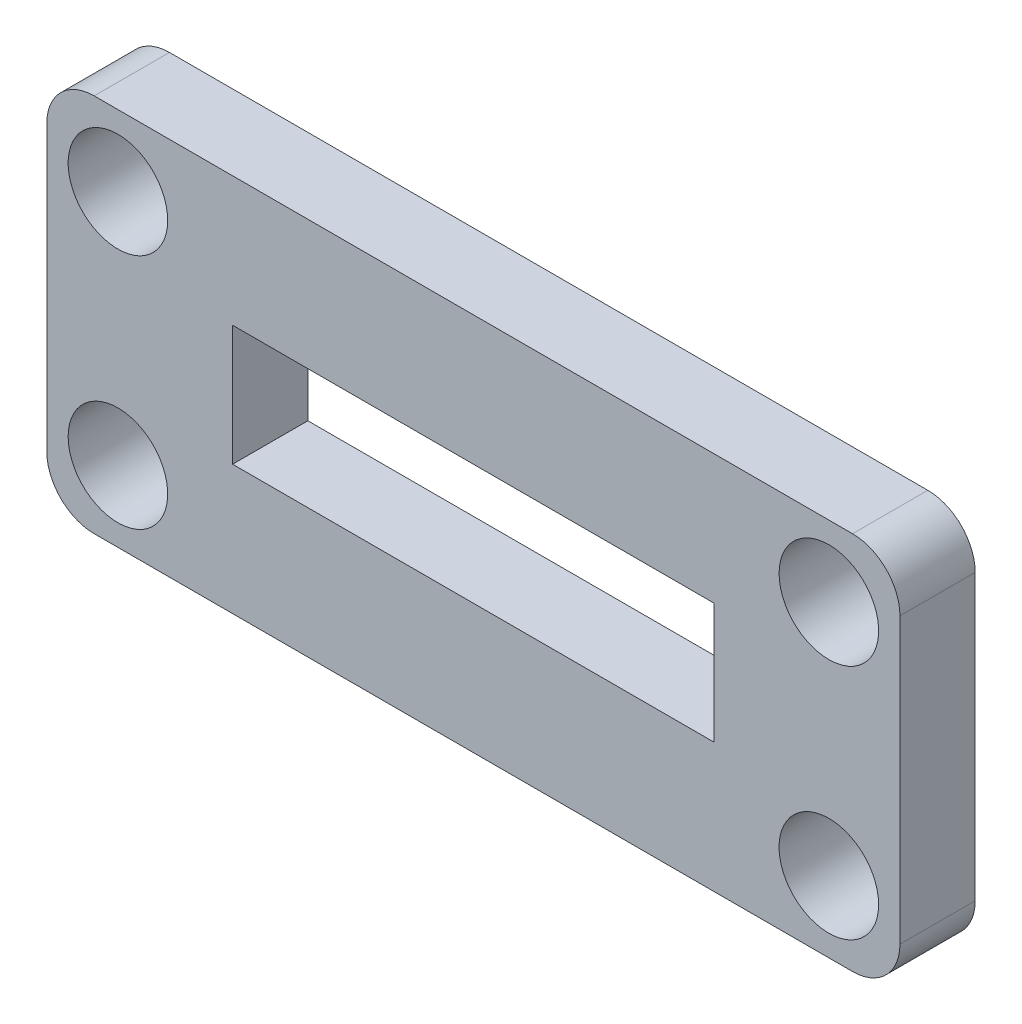
ISO-10303-21;
HEADER;
FILE_DESCRIPTION(('STEP AP214'),'2;1');
FILE_NAME('part.step','',(''),(''),'','','');
FILE_SCHEMA(('AUTOMOTIVE_DESIGN { 1 0 10303 214 1 1 1 1 }'));
ENDSEC;
DATA;
#1=APPLICATION_CONTEXT('core data for automotive mechanical design processes');
#2=APPLICATION_PROTOCOL_DEFINITION('international standard','automotive_design',2000,#1);
#3=PRODUCT_CONTEXT('',#1,'mechanical');
#4=PRODUCT('Part','Part','',(#3));
#5=PRODUCT_RELATED_PRODUCT_CATEGORY('part','',(#4));
#6=PRODUCT_DEFINITION_FORMATION('','',#4);
#7=PRODUCT_DEFINITION_CONTEXT('part definition',#1,'design');
#8=PRODUCT_DEFINITION('design','',#6,#7);
#9=PRODUCT_DEFINITION_SHAPE('','',#8);
#10=(LENGTH_UNIT() NAMED_UNIT(*) SI_UNIT(.MILLI.,.METRE.));
#11=(NAMED_UNIT(*) PLANE_ANGLE_UNIT() SI_UNIT($,.RADIAN.));
#12=(NAMED_UNIT(*) SI_UNIT($,.STERADIAN.) SOLID_ANGLE_UNIT());
#13=UNCERTAINTY_MEASURE_WITH_UNIT(LENGTH_MEASURE(1.E-05),#10,'distance_accuracy_value','');
#14=(GEOMETRIC_REPRESENTATION_CONTEXT(3) GLOBAL_UNCERTAINTY_ASSIGNED_CONTEXT((#13)) GLOBAL_UNIT_ASSIGNED_CONTEXT((#10,
#11,#12)) REPRESENTATION_CONTEXT('',''));
#15=CARTESIAN_POINT('',(0.,0.,0.));
#16=DIRECTION('',(0.,0.,1.));
#17=DIRECTION('',(1.,0.,0.));
#18=AXIS2_PLACEMENT_3D('',#15,#16,#17);
#19=CARTESIAN_POINT('',(16.,6.,3.175));
#20=DIRECTION('',(0.,0.,1.));
#21=DIRECTION('',(1.,0.,0.));
#22=AXIS2_PLACEMENT_3D('',#19,#20,#21);
#23=PLANE('',#22);
#24=DIRECTION('',(-1.,0.,0.));
#25=VECTOR('',#24,1.);
#26=CARTESIAN_POINT('',(10.16,2.53999999999999,3.175));
#27=LINE('',#26,#25);
#28=CARTESIAN_POINT('',(10.16,2.53999999999999,3.175));
#29=VERTEX_POINT('',#28);
#30=CARTESIAN_POINT('',(-10.16,2.54,3.175));
#31=VERTEX_POINT('',#30);
#32=EDGE_CURVE('E130',#29,#31,#27,.T.);
#33=ORIENTED_EDGE('',*,*,#32,.F.);
#34=DIRECTION('',(0.,1.,0.));
#35=VECTOR('',#34,1.);
#36=CARTESIAN_POINT('',(10.16,-2.54,3.175));
#37=LINE('',#36,#35);
#38=CARTESIAN_POINT('',(10.16,-2.54,3.175));
#39=VERTEX_POINT('',#38);
#40=EDGE_CURVE('E122',#39,#29,#37,.T.);
#41=ORIENTED_EDGE('',*,*,#40,.F.);
#42=DIRECTION('',(1.,0.,0.));
#43=VECTOR('',#42,1.);
#44=CARTESIAN_POINT('',(10.16,-2.54,3.175));
#45=LINE('',#44,#43);
#46=CARTESIAN_POINT('',(-10.16,-2.54,3.175));
#47=VERTEX_POINT('',#46);
#48=EDGE_CURVE('E145',#47,#39,#45,.T.);
#49=ORIENTED_EDGE('',*,*,#48,.F.);
#50=DIRECTION('',(0.,-1.,0.));
#51=VECTOR('',#50,1.);
#52=CARTESIAN_POINT('',(-10.16,-2.54,3.175));
#53=LINE('',#52,#51);
#54=EDGE_CURVE('E143',#31,#47,#53,.T.);
#55=ORIENTED_EDGE('',*,*,#54,.F.);
#56=EDGE_LOOP('',(#33,#41,#49,#55));
#57=FACE_BOUND('',#56,.T.);
#58=CARTESIAN_POINT('',(-15.,-5.,3.175));
#59=DIRECTION('',(0.,0.,1.));
#60=DIRECTION('',(-1.,0.,0.));
#61=AXIS2_PLACEMENT_3D('',#58,#59,#60);
#62=CIRCLE('',#61,2.1);
#63=CARTESIAN_POINT('',(-17.1,-5.,3.175));
#64=VERTEX_POINT('',#63);
#65=EDGE_CURVE('E167',#64,#64,#62,.T.);
#66=ORIENTED_EDGE('',*,*,#65,.F.);
#67=EDGE_LOOP('',(#66));
#68=FACE_BOUND('',#67,.T.);
#69=CARTESIAN_POINT('',(16.,6.,3.175));
#70=DIRECTION('',(0.,0.,1.));
#71=DIRECTION('',(1.,0.,0.));
#72=AXIS2_PLACEMENT_3D('',#69,#70,#71);
#73=CIRCLE('',#72,2.);
#74=CARTESIAN_POINT('',(18.,6.,3.175));
#75=VERTEX_POINT('',#74);
#76=CARTESIAN_POINT('',(16.,8.,3.175));
#77=VERTEX_POINT('',#76);
#78=EDGE_CURVE('E179',#75,#77,#73,.T.);
#79=ORIENTED_EDGE('',*,*,#78,.T.);
#80=DIRECTION('',(-1.,0.,0.));
#81=VECTOR('',#80,1.);
#82=CARTESIAN_POINT('',(16.,8.,3.175));
#83=LINE('',#82,#81);
#84=CARTESIAN_POINT('',(-16.,7.99999999999999,3.175));
#85=VERTEX_POINT('',#84);
#86=EDGE_CURVE('E182',#77,#85,#83,.T.);
#87=ORIENTED_EDGE('',*,*,#86,.T.);
#88=CARTESIAN_POINT('',(-16.,6.,3.175));
#89=DIRECTION('',(0.,0.,1.));
#90=DIRECTION('',(1.,0.,0.));
#91=AXIS2_PLACEMENT_3D('',#88,#89,#90);
#92=CIRCLE('',#91,2.);
#93=CARTESIAN_POINT('',(-18.,6.,3.175));
#94=VERTEX_POINT('',#93);
#95=EDGE_CURVE('E185',#85,#94,#92,.T.);
#96=ORIENTED_EDGE('',*,*,#95,.T.);
#97=DIRECTION('',(0.,-1.,0.));
#98=VECTOR('',#97,1.);
#99=CARTESIAN_POINT('',(-18.,-6.,3.175));
#100=LINE('',#99,#98);
#101=CARTESIAN_POINT('',(-18.,-6.,3.175));
#102=VERTEX_POINT('',#101);
#103=EDGE_CURVE('E187',#94,#102,#100,.T.);
#104=ORIENTED_EDGE('',*,*,#103,.T.);
#105=CARTESIAN_POINT('',(-16.,-6.,3.175));
#106=DIRECTION('',(0.,0.,1.));
#107=DIRECTION('',(1.,0.,0.));
#108=AXIS2_PLACEMENT_3D('',#105,#106,#107);
#109=CIRCLE('',#108,2.);
#110=CARTESIAN_POINT('',(-16.,-8.,3.175));
#111=VERTEX_POINT('',#110);
#112=EDGE_CURVE('E189',#102,#111,#109,.T.);
#113=ORIENTED_EDGE('',*,*,#112,.T.);
#114=DIRECTION('',(1.,0.,0.));
#115=VECTOR('',#114,1.);
#116=CARTESIAN_POINT('',(16.,-8.,3.175));
#117=LINE('',#116,#115);
#118=CARTESIAN_POINT('',(16.,-8.,3.175));
#119=VERTEX_POINT('',#118);
#120=EDGE_CURVE('E191',#111,#119,#117,.T.);
#121=ORIENTED_EDGE('',*,*,#120,.T.);
#122=CARTESIAN_POINT('',(16.,-6.,3.175));
#123=DIRECTION('',(0.,0.,1.));
#124=DIRECTION('',(1.,0.,0.));
#125=AXIS2_PLACEMENT_3D('',#122,#123,#124);
#126=CIRCLE('',#125,2.);
#127=CARTESIAN_POINT('',(18.,-6.,3.175));
#128=VERTEX_POINT('',#127);
#129=EDGE_CURVE('E193',#119,#128,#126,.T.);
#130=ORIENTED_EDGE('',*,*,#129,.T.);
#131=DIRECTION('',(0.,1.,0.));
#132=VECTOR('',#131,1.);
#133=CARTESIAN_POINT('',(18.,-6.,3.175));
#134=LINE('',#133,#132);
#135=EDGE_CURVE('E195',#128,#75,#134,.T.);
#136=ORIENTED_EDGE('',*,*,#135,.T.);
#137=EDGE_LOOP('',(#79,#87,#96,#104,#113,#121,#130,#136));
#138=FACE_BOUND('',#137,.T.);
#139=CARTESIAN_POINT('',(15.,5.,3.175));
#140=DIRECTION('',(0.,0.,1.));
#141=DIRECTION('',(-1.,0.,0.));
#142=AXIS2_PLACEMENT_3D('',#139,#140,#141);
#143=CIRCLE('',#142,2.1);
#144=CARTESIAN_POINT('',(12.9,5.,3.175));
#145=VERTEX_POINT('',#144);
#146=EDGE_CURVE('E173',#145,#145,#143,.T.);
#147=ORIENTED_EDGE('',*,*,#146,.F.);
#148=EDGE_LOOP('',(#147));
#149=FACE_BOUND('',#148,.T.);
#150=CARTESIAN_POINT('',(15.,-5.,3.175));
#151=DIRECTION('',(0.,0.,1.));
#152=DIRECTION('',(1.,0.,0.));
#153=AXIS2_PLACEMENT_3D('',#150,#151,#152);
#154=CIRCLE('',#153,2.1);
#155=CARTESIAN_POINT('',(17.1,-5.,3.175));
#156=VERTEX_POINT('',#155);
#157=EDGE_CURVE('E161',#156,#156,#154,.T.);
#158=ORIENTED_EDGE('',*,*,#157,.F.);
#159=EDGE_LOOP('',(#158));
#160=FACE_BOUND('',#159,.T.);
#161=CARTESIAN_POINT('',(-15.,5.,3.175));
#162=DIRECTION('',(0.,0.,1.));
#163=DIRECTION('',(1.,0.,0.));
#164=AXIS2_PLACEMENT_3D('',#161,#162,#163);
#165=CIRCLE('',#164,2.1);
#166=CARTESIAN_POINT('',(-12.9,5.,3.175));
#167=VERTEX_POINT('',#166);
#168=EDGE_CURVE('E151',#167,#167,#165,.T.);
#169=ORIENTED_EDGE('',*,*,#168,.F.);
#170=EDGE_LOOP('',(#169));
#171=FACE_BOUND('',#170,.T.);
#172=ADVANCED_FACE('F33',(#57,#68,#138,#149,#160,#171),#23,.T.);
#173=CARTESIAN_POINT('',(16.,6.,0.));
#174=DIRECTION('',(0.,0.,1.));
#175=DIRECTION('',(1.,0.,0.));
#176=AXIS2_PLACEMENT_3D('',#173,#174,#175);
#177=PLANE('',#176);
#178=DIRECTION('',(0.,1.,0.));
#179=VECTOR('',#178,1.);
#180=CARTESIAN_POINT('',(10.16,-2.54,0.));
#181=LINE('',#180,#179);
#182=CARTESIAN_POINT('',(10.16,-2.54,0.));
#183=VERTEX_POINT('',#182);
#184=CARTESIAN_POINT('',(10.16,2.53999999999999,0.));
#185=VERTEX_POINT('',#184);
#186=EDGE_CURVE('E56',#183,#185,#181,.T.);
#187=ORIENTED_EDGE('',*,*,#186,.T.);
#188=DIRECTION('',(-1.,0.,0.));
#189=VECTOR('',#188,1.);
#190=CARTESIAN_POINT('',(10.16,2.53999999999999,0.));
#191=LINE('',#190,#189);
#192=CARTESIAN_POINT('',(-10.16,2.54,0.));
#193=VERTEX_POINT('',#192);
#194=EDGE_CURVE('E137',#185,#193,#191,.T.);
#195=ORIENTED_EDGE('',*,*,#194,.T.);
#196=DIRECTION('',(0.,-1.,0.));
#197=VECTOR('',#196,1.);
#198=CARTESIAN_POINT('',(-10.16,-2.54,0.));
#199=LINE('',#198,#197);
#200=CARTESIAN_POINT('',(-10.16,-2.54,0.));
#201=VERTEX_POINT('',#200);
#202=EDGE_CURVE('E153',#193,#201,#199,.T.);
#203=ORIENTED_EDGE('',*,*,#202,.T.);
#204=DIRECTION('',(1.,0.,0.));
#205=VECTOR('',#204,1.);
#206=CARTESIAN_POINT('',(10.16,-2.54,0.));
#207=LINE('',#206,#205);
#208=EDGE_CURVE('E131',#201,#183,#207,.T.);
#209=ORIENTED_EDGE('',*,*,#208,.T.);
#210=EDGE_LOOP('',(#187,#195,#203,#209));
#211=FACE_BOUND('',#210,.T.);
#212=CARTESIAN_POINT('',(-15.,-5.,0.));
#213=DIRECTION('',(0.,0.,1.));
#214=DIRECTION('',(-1.,0.,0.));
#215=AXIS2_PLACEMENT_3D('',#212,#213,#214);
#216=CIRCLE('',#215,2.1);
#217=CARTESIAN_POINT('',(-17.1,-5.,0.));
#218=VERTEX_POINT('',#217);
#219=EDGE_CURVE('E164',#218,#218,#216,.T.);
#220=ORIENTED_EDGE('',*,*,#219,.T.);
#221=EDGE_LOOP('',(#220));
#222=FACE_BOUND('',#221,.T.);
#223=CARTESIAN_POINT('',(16.,6.,0.));
#224=DIRECTION('',(0.,0.,1.));
#225=DIRECTION('',(1.,0.,0.));
#226=AXIS2_PLACEMENT_3D('',#223,#224,#225);
#227=CIRCLE('',#226,2.);
#228=CARTESIAN_POINT('',(18.,6.,0.));
#229=VERTEX_POINT('',#228);
#230=CARTESIAN_POINT('',(16.,8.,0.));
#231=VERTEX_POINT('',#230);
#232=EDGE_CURVE('E176',#229,#231,#227,.T.);
#233=ORIENTED_EDGE('',*,*,#232,.F.);
#234=DIRECTION('',(0.,1.,0.));
#235=VECTOR('',#234,1.);
#236=CARTESIAN_POINT('',(18.,-6.,0.));
#237=LINE('',#236,#235);
#238=CARTESIAN_POINT('',(18.,-6.,0.));
#239=VERTEX_POINT('',#238);
#240=EDGE_CURVE('E183',#239,#229,#237,.T.);
#241=ORIENTED_EDGE('',*,*,#240,.F.);
#242=CARTESIAN_POINT('',(16.,-6.,0.));
#243=DIRECTION('',(0.,0.,1.));
#244=DIRECTION('',(1.,0.,0.));
#245=AXIS2_PLACEMENT_3D('',#242,#243,#244);
#246=CIRCLE('',#245,2.);
#247=CARTESIAN_POINT('',(16.,-8.,0.));
#248=VERTEX_POINT('',#247);
#249=EDGE_CURVE('E210',#248,#239,#246,.T.);
#250=ORIENTED_EDGE('',*,*,#249,.F.);
#251=DIRECTION('',(1.,0.,0.));
#252=VECTOR('',#251,1.);
#253=CARTESIAN_POINT('',(16.,-8.,0.));
#254=LINE('',#253,#252);
#255=CARTESIAN_POINT('',(-16.,-8.,0.));
#256=VERTEX_POINT('',#255);
#257=EDGE_CURVE('E208',#256,#248,#254,.T.);
#258=ORIENTED_EDGE('',*,*,#257,.F.);
#259=CARTESIAN_POINT('',(-16.,-6.,0.));
#260=DIRECTION('',(0.,0.,1.));
#261=DIRECTION('',(1.,0.,0.));
#262=AXIS2_PLACEMENT_3D('',#259,#260,#261);
#263=CIRCLE('',#262,2.);
#264=CARTESIAN_POINT('',(-18.,-6.,0.));
#265=VERTEX_POINT('',#264);
#266=EDGE_CURVE('E206',#265,#256,#263,.T.);
#267=ORIENTED_EDGE('',*,*,#266,.F.);
#268=DIRECTION('',(0.,-1.,0.));
#269=VECTOR('',#268,1.);
#270=CARTESIAN_POINT('',(-18.,-6.,0.));
#271=LINE('',#270,#269);
#272=CARTESIAN_POINT('',(-18.,6.,0.));
#273=VERTEX_POINT('',#272);
#274=EDGE_CURVE('E204',#273,#265,#271,.T.);
#275=ORIENTED_EDGE('',*,*,#274,.F.);
#276=CARTESIAN_POINT('',(-16.,6.,0.));
#277=DIRECTION('',(0.,0.,1.));
#278=DIRECTION('',(1.,0.,0.));
#279=AXIS2_PLACEMENT_3D('',#276,#277,#278);
#280=CIRCLE('',#279,2.);
#281=CARTESIAN_POINT('',(-16.,7.99999999999999,0.));
#282=VERTEX_POINT('',#281);
#283=EDGE_CURVE('E202',#282,#273,#280,.T.);
#284=ORIENTED_EDGE('',*,*,#283,.F.);
#285=DIRECTION('',(-1.,0.,0.));
#286=VECTOR('',#285,1.);
#287=CARTESIAN_POINT('',(16.,8.,0.));
#288=LINE('',#287,#286);
#289=EDGE_CURVE('E200',#231,#282,#288,.T.);
#290=ORIENTED_EDGE('',*,*,#289,.F.);
#291=EDGE_LOOP('',(#233,#241,#250,#258,#267,#275,#284,#290));
#292=FACE_BOUND('',#291,.T.);
#293=CARTESIAN_POINT('',(15.,5.,0.));
#294=DIRECTION('',(0.,0.,1.));
#295=DIRECTION('',(-1.,0.,0.));
#296=AXIS2_PLACEMENT_3D('',#293,#294,#295);
#297=CIRCLE('',#296,2.1);
#298=CARTESIAN_POINT('',(12.9,5.,0.));
#299=VERTEX_POINT('',#298);
#300=EDGE_CURVE('E170',#299,#299,#297,.T.);
#301=ORIENTED_EDGE('',*,*,#300,.T.);
#302=EDGE_LOOP('',(#301));
#303=FACE_BOUND('',#302,.T.);
#304=CARTESIAN_POINT('',(15.,-5.,0.));
#305=DIRECTION('',(0.,0.,1.));
#306=DIRECTION('',(1.,0.,0.));
#307=AXIS2_PLACEMENT_3D('',#304,#305,#306);
#308=CIRCLE('',#307,2.1);
#309=CARTESIAN_POINT('',(17.1,-5.,0.));
#310=VERTEX_POINT('',#309);
#311=EDGE_CURVE('E138',#310,#310,#308,.T.);
#312=ORIENTED_EDGE('',*,*,#311,.T.);
#313=EDGE_LOOP('',(#312));
#314=FACE_BOUND('',#313,.T.);
#315=CARTESIAN_POINT('',(-15.,5.,0.));
#316=DIRECTION('',(0.,0.,1.));
#317=DIRECTION('',(1.,0.,0.));
#318=AXIS2_PLACEMENT_3D('',#315,#316,#317);
#319=CIRCLE('',#318,2.1);
#320=CARTESIAN_POINT('',(-12.9,5.,0.));
#321=VERTEX_POINT('',#320);
#322=EDGE_CURVE('E310',#321,#321,#319,.T.);
#323=ORIENTED_EDGE('',*,*,#322,.T.);
#324=EDGE_LOOP('',(#323));
#325=FACE_BOUND('',#324,.T.);
#326=ADVANCED_FACE('F240',(#211,#222,#292,#303,#314,#325),#177,.F.);
#327=CARTESIAN_POINT('',(16.,6.,3.175));
#328=DIRECTION('',(0.,0.,-1.));
#329=DIRECTION('',(-1.,0.,0.));
#330=AXIS2_PLACEMENT_3D('',#327,#328,#329);
#331=CYLINDRICAL_SURFACE('',#330,2.);
#332=ORIENTED_EDGE('',*,*,#232,.T.);
#333=DIRECTION('',(0.,0.,-1.));
#334=VECTOR('',#333,1.);
#335=CARTESIAN_POINT('',(16.,8.,3.175));
#336=LINE('',#335,#334);
#337=EDGE_CURVE('E11',#77,#231,#336,.T.);
#338=ORIENTED_EDGE('',*,*,#337,.F.);
#339=ORIENTED_EDGE('',*,*,#78,.F.);
#340=DIRECTION('',(0.,0.,-1.));
#341=VECTOR('',#340,1.);
#342=CARTESIAN_POINT('',(18.,6.,3.175));
#343=LINE('',#342,#341);
#344=EDGE_CURVE('E197',#75,#229,#343,.T.);
#345=ORIENTED_EDGE('',*,*,#344,.T.);
#346=EDGE_LOOP('',(#332,#338,#339,#345));
#347=FACE_BOUND('',#346,.T.);
#348=ADVANCED_FACE('F35',(#347),#331,.T.);
#349=CARTESIAN_POINT('',(16.,8.,3.175));
#350=DIRECTION('',(0.,-1.,0.));
#351=DIRECTION('',(1.,0.,0.));
#352=AXIS2_PLACEMENT_3D('',#349,#350,#351);
#353=PLANE('',#352);
#354=ORIENTED_EDGE('',*,*,#289,.T.);
#355=DIRECTION('',(0.,0.,-1.));
#356=VECTOR('',#355,1.);
#357=CARTESIAN_POINT('',(-16.,7.99999999999999,3.175));
#358=LINE('',#357,#356);
#359=EDGE_CURVE('E41',#85,#282,#358,.T.);
#360=ORIENTED_EDGE('',*,*,#359,.F.);
#361=ORIENTED_EDGE('',*,*,#86,.F.);
#362=ORIENTED_EDGE('',*,*,#337,.T.);
#363=EDGE_LOOP('',(#354,#360,#361,#362));
#364=FACE_BOUND('',#363,.T.);
#365=ADVANCED_FACE('F258',(#364),#353,.F.);
#366=CARTESIAN_POINT('',(-16.,6.,3.175));
#367=DIRECTION('',(0.,0.,-1.));
#368=DIRECTION('',(-1.,0.,0.));
#369=AXIS2_PLACEMENT_3D('',#366,#367,#368);
#370=CYLINDRICAL_SURFACE('',#369,2.);
#371=ORIENTED_EDGE('',*,*,#283,.T.);
#372=DIRECTION('',(0.,0.,-1.));
#373=VECTOR('',#372,1.);
#374=CARTESIAN_POINT('',(-18.,6.,3.175));
#375=LINE('',#374,#373);
#376=EDGE_CURVE('E227',#94,#273,#375,.T.);
#377=ORIENTED_EDGE('',*,*,#376,.F.);
#378=ORIENTED_EDGE('',*,*,#95,.F.);
#379=ORIENTED_EDGE('',*,*,#359,.T.);
#380=EDGE_LOOP('',(#371,#377,#378,#379));
#381=FACE_BOUND('',#380,.T.);
#382=ADVANCED_FACE('F234',(#381),#370,.T.);
#383=CARTESIAN_POINT('',(-18.,-6.,3.175));
#384=DIRECTION('',(1.,0.,0.));
#385=DIRECTION('',(0.,0.,-1.));
#386=AXIS2_PLACEMENT_3D('',#383,#384,#385);
#387=PLANE('',#386);
#388=ORIENTED_EDGE('',*,*,#274,.T.);
#389=DIRECTION('',(0.,0.,-1.));
#390=VECTOR('',#389,1.);
#391=CARTESIAN_POINT('',(-18.,-6.,3.175));
#392=LINE('',#391,#390);
#393=EDGE_CURVE('E224',#102,#265,#392,.T.);
#394=ORIENTED_EDGE('',*,*,#393,.F.);
#395=ORIENTED_EDGE('',*,*,#103,.F.);
#396=ORIENTED_EDGE('',*,*,#376,.T.);
#397=EDGE_LOOP('',(#388,#394,#395,#396));
#398=FACE_BOUND('',#397,.T.);
#399=ADVANCED_FACE('F246',(#398),#387,.F.);
#400=CARTESIAN_POINT('',(-16.,-6.,3.175));
#401=DIRECTION('',(0.,0.,-1.));
#402=DIRECTION('',(-1.,0.,0.));
#403=AXIS2_PLACEMENT_3D('',#400,#401,#402);
#404=CYLINDRICAL_SURFACE('',#403,2.);
#405=ORIENTED_EDGE('',*,*,#266,.T.);
#406=DIRECTION('',(0.,0.,-1.));
#407=VECTOR('',#406,1.);
#408=CARTESIAN_POINT('',(-16.,-8.,3.175));
#409=LINE('',#408,#407);
#410=EDGE_CURVE('E221',#111,#256,#409,.T.);
#411=ORIENTED_EDGE('',*,*,#410,.F.);
#412=ORIENTED_EDGE('',*,*,#112,.F.);
#413=ORIENTED_EDGE('',*,*,#393,.T.);
#414=EDGE_LOOP('',(#405,#411,#412,#413));
#415=FACE_BOUND('',#414,.T.);
#416=ADVANCED_FACE('F250',(#415),#404,.T.);
#417=CARTESIAN_POINT('',(16.,-8.,3.175));
#418=DIRECTION('',(0.,1.,0.));
#419=DIRECTION('',(0.,0.,1.));
#420=AXIS2_PLACEMENT_3D('',#417,#418,#419);
#421=PLANE('',#420);
#422=ORIENTED_EDGE('',*,*,#257,.T.);
#423=DIRECTION('',(0.,0.,-1.));
#424=VECTOR('',#423,1.);
#425=CARTESIAN_POINT('',(16.,-8.,3.175));
#426=LINE('',#425,#424);
#427=EDGE_CURVE('E218',#119,#248,#426,.T.);
#428=ORIENTED_EDGE('',*,*,#427,.F.);
#429=ORIENTED_EDGE('',*,*,#120,.F.);
#430=ORIENTED_EDGE('',*,*,#410,.T.);
#431=EDGE_LOOP('',(#422,#428,#429,#430));
#432=FACE_BOUND('',#431,.T.);
#433=ADVANCED_FACE('F271',(#432),#421,.F.);
#434=CARTESIAN_POINT('',(16.,-6.,3.175));
#435=DIRECTION('',(0.,0.,-1.));
#436=DIRECTION('',(-1.,0.,0.));
#437=AXIS2_PLACEMENT_3D('',#434,#435,#436);
#438=CYLINDRICAL_SURFACE('',#437,2.);
#439=ORIENTED_EDGE('',*,*,#249,.T.);
#440=DIRECTION('',(0.,0.,-1.));
#441=VECTOR('',#440,1.);
#442=CARTESIAN_POINT('',(18.,-6.,3.175));
#443=LINE('',#442,#441);
#444=EDGE_CURVE('E215',#128,#239,#443,.T.);
#445=ORIENTED_EDGE('',*,*,#444,.F.);
#446=ORIENTED_EDGE('',*,*,#129,.F.);
#447=ORIENTED_EDGE('',*,*,#427,.T.);
#448=EDGE_LOOP('',(#439,#445,#446,#447));
#449=FACE_BOUND('',#448,.T.);
#450=ADVANCED_FACE('F269',(#449),#438,.T.);
#451=CARTESIAN_POINT('',(18.,-6.,3.175));
#452=DIRECTION('',(-1.,0.,0.));
#453=DIRECTION('',(0.,0.,1.));
#454=AXIS2_PLACEMENT_3D('',#451,#452,#453);
#455=PLANE('',#454);
#456=ORIENTED_EDGE('',*,*,#240,.T.);
#457=ORIENTED_EDGE('',*,*,#344,.F.);
#458=ORIENTED_EDGE('',*,*,#135,.F.);
#459=ORIENTED_EDGE('',*,*,#444,.T.);
#460=EDGE_LOOP('',(#456,#457,#458,#459));
#461=FACE_BOUND('',#460,.T.);
#462=ADVANCED_FACE('F264',(#461),#455,.F.);
#463=CARTESIAN_POINT('',(15.,5.,3.175));
#464=DIRECTION('',(0.,0.,-1.));
#465=DIRECTION('',(-1.,0.,0.));
#466=AXIS2_PLACEMENT_3D('',#463,#464,#465);
#467=CYLINDRICAL_SURFACE('',#466,2.1);
#468=ORIENTED_EDGE('',*,*,#146,.T.);
#469=EDGE_LOOP('',(#468));
#470=FACE_BOUND('',#469,.T.);
#471=ORIENTED_EDGE('',*,*,#300,.F.);
#472=EDGE_LOOP('',(#471));
#473=FACE_BOUND('',#472,.T.);
#474=ADVANCED_FACE('F288',(#470,#473),#467,.F.);
#475=CARTESIAN_POINT('',(-15.,-5.,3.175));
#476=DIRECTION('',(0.,0.,-1.));
#477=DIRECTION('',(-1.,0.,0.));
#478=AXIS2_PLACEMENT_3D('',#475,#476,#477);
#479=CYLINDRICAL_SURFACE('',#478,2.1);
#480=ORIENTED_EDGE('',*,*,#65,.T.);
#481=EDGE_LOOP('',(#480));
#482=FACE_BOUND('',#481,.T.);
#483=ORIENTED_EDGE('',*,*,#219,.F.);
#484=EDGE_LOOP('',(#483));
#485=FACE_BOUND('',#484,.T.);
#486=ADVANCED_FACE('F295',(#482,#485),#479,.F.);
#487=CARTESIAN_POINT('',(15.,-5.,3.175));
#488=DIRECTION('',(0.,0.,-1.));
#489=DIRECTION('',(-1.,0.,0.));
#490=AXIS2_PLACEMENT_3D('',#487,#488,#489);
#491=CYLINDRICAL_SURFACE('',#490,2.1);
#492=ORIENTED_EDGE('',*,*,#157,.T.);
#493=EDGE_LOOP('',(#492));
#494=FACE_BOUND('',#493,.T.);
#495=ORIENTED_EDGE('',*,*,#311,.F.);
#496=EDGE_LOOP('',(#495));
#497=FACE_BOUND('',#496,.T.);
#498=ADVANCED_FACE('F300',(#494,#497),#491,.F.);
#499=CARTESIAN_POINT('',(10.16,-2.54,3.175));
#500=DIRECTION('',(-1.,0.,0.));
#501=DIRECTION('',(0.,0.,1.));
#502=AXIS2_PLACEMENT_3D('',#499,#500,#501);
#503=PLANE('',#502);
#504=ORIENTED_EDGE('',*,*,#186,.F.);
#505=DIRECTION('',(0.,0.,-1.));
#506=VECTOR('',#505,1.);
#507=CARTESIAN_POINT('',(10.16,-2.54,3.175));
#508=LINE('',#507,#506);
#509=EDGE_CURVE('E126',#39,#183,#508,.T.);
#510=ORIENTED_EDGE('',*,*,#509,.F.);
#511=ORIENTED_EDGE('',*,*,#40,.T.);
#512=DIRECTION('',(0.,0.,-1.));
#513=VECTOR('',#512,1.);
#514=CARTESIAN_POINT('',(10.16,2.53999999999999,3.175));
#515=LINE('',#514,#513);
#516=EDGE_CURVE('E125',#29,#185,#515,.T.);
#517=ORIENTED_EDGE('',*,*,#516,.T.);
#518=EDGE_LOOP('',(#504,#510,#511,#517));
#519=FACE_BOUND('',#518,.T.);
#520=ADVANCED_FACE('F124',(#519),#503,.T.);
#521=CARTESIAN_POINT('',(10.16,2.53999999999999,3.175));
#522=DIRECTION('',(0.,-1.,0.));
#523=DIRECTION('',(1.,0.,0.));
#524=AXIS2_PLACEMENT_3D('',#521,#522,#523);
#525=PLANE('',#524);
#526=ORIENTED_EDGE('',*,*,#194,.F.);
#527=ORIENTED_EDGE('',*,*,#516,.F.);
#528=ORIENTED_EDGE('',*,*,#32,.T.);
#529=DIRECTION('',(0.,0.,-1.));
#530=VECTOR('',#529,1.);
#531=CARTESIAN_POINT('',(-10.16,2.54,3.175));
#532=LINE('',#531,#530);
#533=EDGE_CURVE('E139',#31,#193,#532,.T.);
#534=ORIENTED_EDGE('',*,*,#533,.T.);
#535=EDGE_LOOP('',(#526,#527,#528,#534));
#536=FACE_BOUND('',#535,.T.);
#537=ADVANCED_FACE('F134',(#536),#525,.T.);
#538=CARTESIAN_POINT('',(-10.16,-2.54,3.175));
#539=DIRECTION('',(1.,0.,0.));
#540=DIRECTION('',(0.,0.,-1.));
#541=AXIS2_PLACEMENT_3D('',#538,#539,#540);
#542=PLANE('',#541);
#543=ORIENTED_EDGE('',*,*,#202,.F.);
#544=ORIENTED_EDGE('',*,*,#533,.F.);
#545=ORIENTED_EDGE('',*,*,#54,.T.);
#546=DIRECTION('',(0.,0.,-1.));
#547=VECTOR('',#546,1.);
#548=CARTESIAN_POINT('',(-10.16,-2.54,3.175));
#549=LINE('',#548,#547);
#550=EDGE_CURVE('E48',#47,#201,#549,.T.);
#551=ORIENTED_EDGE('',*,*,#550,.T.);
#552=EDGE_LOOP('',(#543,#544,#545,#551));
#553=FACE_BOUND('',#552,.T.);
#554=ADVANCED_FACE('F324',(#553),#542,.T.);
#555=CARTESIAN_POINT('',(10.16,-2.54,3.175));
#556=DIRECTION('',(0.,1.,0.));
#557=DIRECTION('',(-1.,0.,0.));
#558=AXIS2_PLACEMENT_3D('',#555,#556,#557);
#559=PLANE('',#558);
#560=ORIENTED_EDGE('',*,*,#208,.F.);
#561=ORIENTED_EDGE('',*,*,#550,.F.);
#562=ORIENTED_EDGE('',*,*,#48,.T.);
#563=ORIENTED_EDGE('',*,*,#509,.T.);
#564=EDGE_LOOP('',(#560,#561,#562,#563));
#565=FACE_BOUND('',#564,.T.);
#566=ADVANCED_FACE('F319',(#565),#559,.T.);
#567=CARTESIAN_POINT('',(-15.,5.,3.175));
#568=DIRECTION('',(0.,0.,-1.));
#569=DIRECTION('',(-1.,0.,0.));
#570=AXIS2_PLACEMENT_3D('',#567,#568,#569);
#571=CYLINDRICAL_SURFACE('',#570,2.1);
#572=ORIENTED_EDGE('',*,*,#168,.T.);
#573=EDGE_LOOP('',(#572));
#574=FACE_BOUND('',#573,.T.);
#575=ORIENTED_EDGE('',*,*,#322,.F.);
#576=EDGE_LOOP('',(#575));
#577=FACE_BOUND('',#576,.T.);
#578=ADVANCED_FACE('F316',(#574,#577),#571,.F.);
#579=CLOSED_SHELL('',(#172,#326,#348,#365,#382,#399,#416,#433,#450,#462,#474,#486,#498,#520,
#537,#554,#566,#578));
#580=MANIFOLD_SOLID_BREP('B2',#579);
#581=ADVANCED_BREP_SHAPE_REPRESENTATION('',(#18,#580),#14);
#582=SHAPE_DEFINITION_REPRESENTATION(#9,#581);
ENDSEC;
END-ISO-10303-21;
